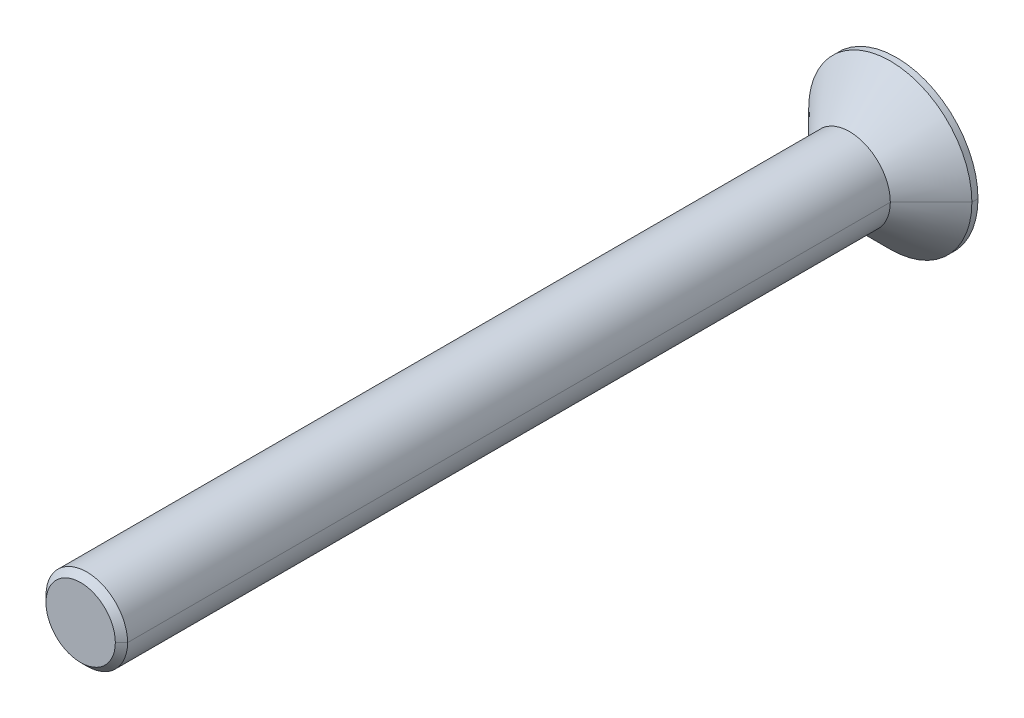
ISO-10303-21;
HEADER;
FILE_DESCRIPTION(('STEP AP214'),'2;1');
FILE_NAME('part.step','',(''),(''),'','','');
FILE_SCHEMA(('AUTOMOTIVE_DESIGN { 1 0 10303 214 1 1 1 1 }'));
ENDSEC;
DATA;
#1=APPLICATION_CONTEXT('core data for automotive mechanical design processes');
#2=APPLICATION_PROTOCOL_DEFINITION('international standard','automotive_design',2000,#1);
#3=PRODUCT_CONTEXT('',#1,'mechanical');
#4=PRODUCT('Part','Part','',(#3));
#5=PRODUCT_RELATED_PRODUCT_CATEGORY('part','',(#4));
#6=PRODUCT_DEFINITION_FORMATION('','',#4);
#7=PRODUCT_DEFINITION_CONTEXT('part definition',#1,'design');
#8=PRODUCT_DEFINITION('design','',#6,#7);
#9=PRODUCT_DEFINITION_SHAPE('','',#8);
#10=(LENGTH_UNIT() NAMED_UNIT(*) SI_UNIT(.MILLI.,.METRE.));
#11=(NAMED_UNIT(*) PLANE_ANGLE_UNIT() SI_UNIT($,.RADIAN.));
#12=(NAMED_UNIT(*) SI_UNIT($,.STERADIAN.) SOLID_ANGLE_UNIT());
#13=UNCERTAINTY_MEASURE_WITH_UNIT(LENGTH_MEASURE(1.E-05),#10,'distance_accuracy_value','');
#14=(GEOMETRIC_REPRESENTATION_CONTEXT(3) GLOBAL_UNCERTAINTY_ASSIGNED_CONTEXT((#13)) GLOBAL_UNIT_ASSIGNED_CONTEXT((#10,
#11,#12)) REPRESENTATION_CONTEXT('',''));
#15=CARTESIAN_POINT('',(0.,0.,0.));
#16=DIRECTION('',(0.,0.,1.));
#17=DIRECTION('',(1.,0.,0.));
#18=AXIS2_PLACEMENT_3D('',#15,#16,#17);
#19=CARTESIAN_POINT('',(0.,0.,-0.3));
#20=DIRECTION('',(0.,0.,-1.));
#21=DIRECTION('',(0.,-1.,0.));
#22=AXIS2_PLACEMENT_3D('',#19,#20,#21);
#23=PLANE('',#22);
#24=DIRECTION('',(-0.5,-0.866025403784439,0.));
#25=VECTOR('',#24,1.);
#26=CARTESIAN_POINT('',(1.44337567297406,0.,-0.3));
#27=LINE('',#26,#25);
#28=CARTESIAN_POINT('',(1.44337567297406,0.,-0.3));
#29=VERTEX_POINT('',#28);
#30=CARTESIAN_POINT('',(0.721687836487032,-1.25,-0.3));
#31=VERTEX_POINT('',#30);
#32=EDGE_CURVE('E124',#29,#31,#27,.T.);
#33=ORIENTED_EDGE('',*,*,#32,.T.);
#34=DIRECTION('',(-1.,0.,0.));
#35=VECTOR('',#34,1.);
#36=CARTESIAN_POINT('',(0.721687836487032,-1.25,-0.3));
#37=LINE('',#36,#35);
#38=CARTESIAN_POINT('',(-0.721687836487033,-1.25,-0.3));
#39=VERTEX_POINT('',#38);
#40=EDGE_CURVE('E11',#31,#39,#37,.T.);
#41=ORIENTED_EDGE('',*,*,#40,.T.);
#42=DIRECTION('',(-0.5,0.866025403784439,0.));
#43=VECTOR('',#42,1.);
#44=CARTESIAN_POINT('',(-0.721687836487033,-1.25,-0.3));
#45=LINE('',#44,#43);
#46=CARTESIAN_POINT('',(-1.44337567297406,0.,-0.3));
#47=VERTEX_POINT('',#46);
#48=EDGE_CURVE('E48',#39,#47,#45,.T.);
#49=ORIENTED_EDGE('',*,*,#48,.T.);
#50=DIRECTION('',(0.5,0.866025403784438,0.));
#51=VECTOR('',#50,1.);
#52=CARTESIAN_POINT('',(-1.44337567297406,0.,-0.3));
#53=LINE('',#52,#51);
#54=CARTESIAN_POINT('',(-0.721687836487032,1.25,-0.3));
#55=VERTEX_POINT('',#54);
#56=EDGE_CURVE('E98',#47,#55,#53,.T.);
#57=ORIENTED_EDGE('',*,*,#56,.T.);
#58=DIRECTION('',(1.,0.,0.));
#59=VECTOR('',#58,1.);
#60=CARTESIAN_POINT('',(-0.721687836487032,1.25,-0.3));
#61=LINE('',#60,#59);
#62=CARTESIAN_POINT('',(0.721687836487033,1.25,-0.3));
#63=VERTEX_POINT('',#62);
#64=EDGE_CURVE('E92',#55,#63,#61,.T.);
#65=ORIENTED_EDGE('',*,*,#64,.T.);
#66=DIRECTION('',(0.5,-0.866025403784439,0.));
#67=VECTOR('',#66,1.);
#68=CARTESIAN_POINT('',(0.721687836487033,1.25,-0.3));
#69=LINE('',#68,#67);
#70=EDGE_CURVE('E95',#63,#29,#69,.T.);
#71=ORIENTED_EDGE('',*,*,#70,.T.);
#72=EDGE_LOOP('',(#33,#41,#49,#57,#65,#71));
#73=FACE_BOUND('',#72,.T.);
#74=ADVANCED_FACE('F17',(#73),#23,.T.);
#75=CARTESIAN_POINT('',(0.721687836487032,-1.25,-0.3));
#76=DIRECTION('',(0.,-1.,0.));
#77=DIRECTION('',(-1.,0.,0.));
#78=AXIS2_PLACEMENT_3D('',#75,#76,#77);
#79=PLANE('',#78);
#80=DIRECTION('',(-1.,0.,0.));
#81=VECTOR('',#80,1.);
#82=CARTESIAN_POINT('',(0.721687836487032,-1.25,-2.3));
#83=LINE('',#82,#81);
#84=CARTESIAN_POINT('',(0.721687836487032,-1.25,-2.3));
#85=VERTEX_POINT('',#84);
#86=CARTESIAN_POINT('',(-0.721687836487033,-1.25,-2.3));
#87=VERTEX_POINT('',#86);
#88=EDGE_CURVE('E154',#85,#87,#83,.T.);
#89=ORIENTED_EDGE('',*,*,#88,.T.);
#90=DIRECTION('',(0.,0.,-1.));
#91=VECTOR('',#90,1.);
#92=CARTESIAN_POINT('',(-0.721687836487033,-1.25,-0.3));
#93=LINE('',#92,#91);
#94=EDGE_CURVE('E20',#39,#87,#93,.T.);
#95=ORIENTED_EDGE('',*,*,#94,.F.);
#96=ORIENTED_EDGE('',*,*,#40,.F.);
#97=DIRECTION('',(0.,0.,-1.));
#98=VECTOR('',#97,1.);
#99=CARTESIAN_POINT('',(0.721687836487032,-1.25,-0.3));
#100=LINE('',#99,#98);
#101=EDGE_CURVE('E158',#31,#85,#100,.T.);
#102=ORIENTED_EDGE('',*,*,#101,.T.);
#103=EDGE_LOOP('',(#89,#95,#96,#102));
#104=FACE_BOUND('',#103,.T.);
#105=ADVANCED_FACE('F160',(#104),#79,.F.);
#106=CARTESIAN_POINT('',(-0.721687836487033,-1.25,-0.3));
#107=DIRECTION('',(-0.866025403784439,-0.5,0.));
#108=DIRECTION('',(-0.5,0.866025403784439,0.));
#109=AXIS2_PLACEMENT_3D('',#106,#107,#108);
#110=PLANE('',#109);
#111=DIRECTION('',(-0.5,0.866025403784439,0.));
#112=VECTOR('',#111,1.);
#113=CARTESIAN_POINT('',(-0.721687836487033,-1.25,-2.3));
#114=LINE('',#113,#112);
#115=CARTESIAN_POINT('',(-1.44337567297406,0.,-2.3));
#116=VERTEX_POINT('',#115);
#117=EDGE_CURVE('E145',#87,#116,#114,.T.);
#118=ORIENTED_EDGE('',*,*,#117,.T.);
#119=DIRECTION('',(0.,0.,-1.));
#120=VECTOR('',#119,1.);
#121=CARTESIAN_POINT('',(-1.44337567297406,0.,-0.3));
#122=LINE('',#121,#120);
#123=EDGE_CURVE('E132',#47,#116,#122,.T.);
#124=ORIENTED_EDGE('',*,*,#123,.F.);
#125=ORIENTED_EDGE('',*,*,#48,.F.);
#126=ORIENTED_EDGE('',*,*,#94,.T.);
#127=EDGE_LOOP('',(#118,#124,#125,#126));
#128=FACE_BOUND('',#127,.T.);
#129=ADVANCED_FACE('F144',(#128),#110,.F.);
#130=CARTESIAN_POINT('',(-1.44337567297406,0.,-0.3));
#131=DIRECTION('',(-0.866025403784438,0.5,0.));
#132=DIRECTION('',(0.,0.,1.));
#133=AXIS2_PLACEMENT_3D('',#130,#131,#132);
#134=PLANE('',#133);
#135=DIRECTION('',(0.5,0.866025403784438,0.));
#136=VECTOR('',#135,1.);
#137=CARTESIAN_POINT('',(-1.44337567297406,0.,-2.3));
#138=LINE('',#137,#136);
#139=CARTESIAN_POINT('',(-0.721687836487032,1.25,-2.3));
#140=VERTEX_POINT('',#139);
#141=EDGE_CURVE('E156',#116,#140,#138,.T.);
#142=ORIENTED_EDGE('',*,*,#141,.T.);
#143=DIRECTION('',(0.,0.,-1.));
#144=VECTOR('',#143,1.);
#145=CARTESIAN_POINT('',(-0.721687836487032,1.25,-0.3));
#146=LINE('',#145,#144);
#147=EDGE_CURVE('E102',#55,#140,#146,.T.);
#148=ORIENTED_EDGE('',*,*,#147,.F.);
#149=ORIENTED_EDGE('',*,*,#56,.F.);
#150=ORIENTED_EDGE('',*,*,#123,.T.);
#151=EDGE_LOOP('',(#142,#148,#149,#150));
#152=FACE_BOUND('',#151,.T.);
#153=ADVANCED_FACE('F343',(#152),#134,.F.);
#154=CARTESIAN_POINT('',(-0.721687836487032,1.25,-0.3));
#155=DIRECTION('',(0.,1.,0.));
#156=DIRECTION('',(1.,0.,0.));
#157=AXIS2_PLACEMENT_3D('',#154,#155,#156);
#158=PLANE('',#157);
#159=DIRECTION('',(1.,0.,0.));
#160=VECTOR('',#159,1.);
#161=CARTESIAN_POINT('',(-0.721687836487032,1.25,-2.3));
#162=LINE('',#161,#160);
#163=CARTESIAN_POINT('',(0.721687836487033,1.25,-2.3));
#164=VERTEX_POINT('',#163);
#165=EDGE_CURVE('E108',#140,#164,#162,.T.);
#166=ORIENTED_EDGE('',*,*,#165,.T.);
#167=DIRECTION('',(0.,0.,-1.));
#168=VECTOR('',#167,1.);
#169=CARTESIAN_POINT('',(0.721687836487033,1.25,-0.3));
#170=LINE('',#169,#168);
#171=EDGE_CURVE('E103',#63,#164,#170,.T.);
#172=ORIENTED_EDGE('',*,*,#171,.F.);
#173=ORIENTED_EDGE('',*,*,#64,.F.);
#174=ORIENTED_EDGE('',*,*,#147,.T.);
#175=EDGE_LOOP('',(#166,#172,#173,#174));
#176=FACE_BOUND('',#175,.T.);
#177=ADVANCED_FACE('F106',(#176),#158,.F.);
#178=CARTESIAN_POINT('',(0.721687836487033,1.25,-0.3));
#179=DIRECTION('',(0.866025403784439,0.5,0.));
#180=DIRECTION('',(0.,0.,-1.));
#181=AXIS2_PLACEMENT_3D('',#178,#179,#180);
#182=PLANE('',#181);
#183=DIRECTION('',(0.5,-0.866025403784439,0.));
#184=VECTOR('',#183,1.);
#185=CARTESIAN_POINT('',(0.721687836487033,1.25,-2.3));
#186=LINE('',#185,#184);
#187=CARTESIAN_POINT('',(1.44337567297406,0.,-2.3));
#188=VERTEX_POINT('',#187);
#189=EDGE_CURVE('E171',#164,#188,#186,.T.);
#190=ORIENTED_EDGE('',*,*,#189,.T.);
#191=DIRECTION('',(0.,0.,-1.));
#192=VECTOR('',#191,1.);
#193=CARTESIAN_POINT('',(1.44337567297406,0.,-0.3));
#194=LINE('',#193,#192);
#195=EDGE_CURVE('E116',#29,#188,#194,.T.);
#196=ORIENTED_EDGE('',*,*,#195,.F.);
#197=ORIENTED_EDGE('',*,*,#70,.F.);
#198=ORIENTED_EDGE('',*,*,#171,.T.);
#199=EDGE_LOOP('',(#190,#196,#197,#198));
#200=FACE_BOUND('',#199,.T.);
#201=ADVANCED_FACE('F114',(#200),#182,.F.);
#202=CARTESIAN_POINT('',(1.44337567297406,0.,-0.3));
#203=DIRECTION('',(0.866025403784439,-0.5,0.));
#204=DIRECTION('',(0.,0.,-1.));
#205=AXIS2_PLACEMENT_3D('',#202,#203,#204);
#206=PLANE('',#205);
#207=DIRECTION('',(-0.5,-0.866025403784439,0.));
#208=VECTOR('',#207,1.);
#209=CARTESIAN_POINT('',(1.44337567297406,0.,-2.3));
#210=LINE('',#209,#208);
#211=EDGE_CURVE('E164',#188,#85,#210,.T.);
#212=ORIENTED_EDGE('',*,*,#211,.T.);
#213=ORIENTED_EDGE('',*,*,#101,.F.);
#214=ORIENTED_EDGE('',*,*,#32,.F.);
#215=ORIENTED_EDGE('',*,*,#195,.T.);
#216=EDGE_LOOP('',(#212,#213,#214,#215));
#217=FACE_BOUND('',#216,.T.);
#218=ADVANCED_FACE('F349',(#217),#206,.F.);
#219=CARTESIAN_POINT('',(0.,0.,37.7));
#220=DIRECTION('',(0.,0.,-1.));
#221=DIRECTION('',(-1.,0.,0.));
#222=AXIS2_PLACEMENT_3D('',#219,#220,#221);
#223=CONICAL_SURFACE('',#222,1.7,0.785398163397469);
#224=DIRECTION('',(0.707106781186562,0.,-0.707106781186533));
#225=VECTOR('',#224,1.);
#226=CARTESIAN_POINT('',(1.7,0.,37.7));
#227=LINE('',#226,#225);
#228=CARTESIAN_POINT('',(1.7,0.,37.7));
#229=VERTEX_POINT('',#228);
#230=CARTESIAN_POINT('',(2.,0.,37.4));
#231=VERTEX_POINT('',#230);
#232=EDGE_CURVE('E200',#229,#231,#227,.T.);
#233=ORIENTED_EDGE('',*,*,#232,.F.);
#234=CARTESIAN_POINT('',(0.,0.,37.7));
#235=DIRECTION('',(0.,0.,1.));
#236=DIRECTION('',(1.,0.,0.));
#237=AXIS2_PLACEMENT_3D('',#234,#235,#236);
#238=CIRCLE('',#237,1.7);
#239=CARTESIAN_POINT('',(-1.7,0.,37.7));
#240=VERTEX_POINT('',#239);
#241=EDGE_CURVE('E174',#240,#229,#238,.T.);
#242=ORIENTED_EDGE('',*,*,#241,.F.);
#243=DIRECTION('',(-0.707106781186562,0.,-0.707106781186533));
#244=VECTOR('',#243,1.);
#245=CARTESIAN_POINT('',(-1.7,0.,37.7));
#246=LINE('',#245,#244);
#247=CARTESIAN_POINT('',(-2.,0.,37.4));
#248=VERTEX_POINT('',#247);
#249=EDGE_CURVE('E212',#240,#248,#246,.T.);
#250=ORIENTED_EDGE('',*,*,#249,.T.);
#251=CARTESIAN_POINT('',(0.,0.,37.4));
#252=DIRECTION('',(0.,0.,-1.));
#253=DIRECTION('',(1.,0.,0.));
#254=AXIS2_PLACEMENT_3D('',#251,#252,#253);
#255=CIRCLE('',#254,2.);
#256=EDGE_CURVE('E238',#231,#248,#255,.T.);
#257=ORIENTED_EDGE('',*,*,#256,.F.);
#258=EDGE_LOOP('',(#233,#242,#250,#257));
#259=FACE_BOUND('',#258,.T.);
#260=ADVANCED_FACE('F258',(#259),#223,.T.);
#261=CARTESIAN_POINT('',(0.,0.,-2.3));
#262=DIRECTION('',(0.,0.,1.));
#263=DIRECTION('',(1.,0.,0.));
#264=AXIS2_PLACEMENT_3D('',#261,#262,#263);
#265=PLANE('',#264);
#266=ORIENTED_EDGE('',*,*,#88,.F.);
#267=ORIENTED_EDGE('',*,*,#211,.F.);
#268=ORIENTED_EDGE('',*,*,#189,.F.);
#269=ORIENTED_EDGE('',*,*,#165,.F.);
#270=ORIENTED_EDGE('',*,*,#141,.F.);
#271=ORIENTED_EDGE('',*,*,#117,.F.);
#272=EDGE_LOOP('',(#266,#267,#268,#269,#270,#271));
#273=FACE_BOUND('',#272,.T.);
#274=CARTESIAN_POINT('',(0.,0.,-2.3));
#275=DIRECTION('',(0.,0.,-1.));
#276=DIRECTION('',(-1.,0.,0.));
#277=AXIS2_PLACEMENT_3D('',#274,#275,#276);
#278=CIRCLE('',#277,4.);
#279=CARTESIAN_POINT('',(-4.,0.,-2.3));
#280=VERTEX_POINT('',#279);
#281=CARTESIAN_POINT('',(4.,0.,-2.3));
#282=VERTEX_POINT('',#281);
#283=EDGE_CURVE('E194',#280,#282,#278,.T.);
#284=ORIENTED_EDGE('',*,*,#283,.T.);
#285=CARTESIAN_POINT('',(0.,0.,-2.3));
#286=DIRECTION('',(0.,0.,-1.));
#287=DIRECTION('',(-1.,0.,0.));
#288=AXIS2_PLACEMENT_3D('',#285,#286,#287);
#289=CIRCLE('',#288,4.);
#290=EDGE_CURVE('E165',#282,#280,#289,.T.);
#291=ORIENTED_EDGE('',*,*,#290,.T.);
#292=EDGE_LOOP('',(#284,#291));
#293=FACE_BOUND('',#292,.T.);
#294=ADVANCED_FACE('F151',(#273,#293),#265,.F.);
#295=CARTESIAN_POINT('',(0.,0.,37.7));
#296=DIRECTION('',(0.,0.,-1.));
#297=DIRECTION('',(-1.,0.,0.));
#298=AXIS2_PLACEMENT_3D('',#295,#296,#297);
#299=CYLINDRICAL_SURFACE('',#298,4.);
#300=DIRECTION('',(0.,0.,-1.));
#301=VECTOR('',#300,1.);
#302=CARTESIAN_POINT('',(4.,0.,37.7));
#303=LINE('',#302,#301);
#304=CARTESIAN_POINT('',(4.,0.,-2.));
#305=VERTEX_POINT('',#304);
#306=EDGE_CURVE('E199',#305,#282,#303,.T.);
#307=ORIENTED_EDGE('',*,*,#306,.F.);
#308=CARTESIAN_POINT('',(0.,0.,-2.));
#309=DIRECTION('',(0.,0.,1.));
#310=DIRECTION('',(-1.,0.,0.));
#311=AXIS2_PLACEMENT_3D('',#308,#309,#310);
#312=CIRCLE('',#311,4.);
#313=CARTESIAN_POINT('',(-4.,0.,-2.));
#314=VERTEX_POINT('',#313);
#315=EDGE_CURVE('E223',#314,#305,#312,.T.);
#316=ORIENTED_EDGE('',*,*,#315,.F.);
#317=DIRECTION('',(0.,0.,-1.));
#318=VECTOR('',#317,1.);
#319=CARTESIAN_POINT('',(-4.,0.,37.7));
#320=LINE('',#319,#318);
#321=EDGE_CURVE('E198',#314,#280,#320,.T.);
#322=ORIENTED_EDGE('',*,*,#321,.T.);
#323=ORIENTED_EDGE('',*,*,#290,.F.);
#324=EDGE_LOOP('',(#307,#316,#322,#323));
#325=FACE_BOUND('',#324,.T.);
#326=ADVANCED_FACE('F321',(#325),#299,.T.);
#327=CARTESIAN_POINT('',(0.,0.,37.7));
#328=DIRECTION('',(0.,0.,1.));
#329=DIRECTION('',(1.,0.,0.));
#330=AXIS2_PLACEMENT_3D('',#327,#328,#329);
#331=PLANE('',#330);
#332=ORIENTED_EDGE('',*,*,#241,.T.);
#333=CARTESIAN_POINT('',(0.,0.,37.7));
#334=DIRECTION('',(0.,0.,1.));
#335=DIRECTION('',(1.,0.,0.));
#336=AXIS2_PLACEMENT_3D('',#333,#334,#335);
#337=CIRCLE('',#336,1.7);
#338=EDGE_CURVE('E204',#229,#240,#337,.T.);
#339=ORIENTED_EDGE('',*,*,#338,.T.);
#340=EDGE_LOOP('',(#332,#339));
#341=FACE_BOUND('',#340,.T.);
#342=ADVANCED_FACE('F250',(#341),#331,.T.);
#343=CARTESIAN_POINT('',(0.,0.,37.7));
#344=DIRECTION('',(0.,0.,-1.));
#345=DIRECTION('',(-1.,0.,0.));
#346=AXIS2_PLACEMENT_3D('',#343,#344,#345);
#347=CYLINDRICAL_SURFACE('',#346,2.);
#348=DIRECTION('',(0.,0.,-1.));
#349=VECTOR('',#348,1.);
#350=CARTESIAN_POINT('',(2.,0.,37.7));
#351=LINE('',#350,#349);
#352=CARTESIAN_POINT('',(2.,0.,0.));
#353=VERTEX_POINT('',#352);
#354=EDGE_CURVE('E192',#231,#353,#351,.T.);
#355=ORIENTED_EDGE('',*,*,#354,.F.);
#356=ORIENTED_EDGE('',*,*,#256,.T.);
#357=DIRECTION('',(0.,0.,-1.));
#358=VECTOR('',#357,1.);
#359=CARTESIAN_POINT('',(-2.,0.,37.7));
#360=LINE('',#359,#358);
#361=CARTESIAN_POINT('',(-2.,0.,0.));
#362=VERTEX_POINT('',#361);
#363=EDGE_CURVE('E211',#248,#362,#360,.T.);
#364=ORIENTED_EDGE('',*,*,#363,.T.);
#365=CARTESIAN_POINT('',(0.,0.,0.));
#366=DIRECTION('',(0.,0.,1.));
#367=DIRECTION('',(1.,0.,0.));
#368=AXIS2_PLACEMENT_3D('',#365,#366,#367);
#369=CIRCLE('',#368,2.);
#370=EDGE_CURVE('E206',#362,#353,#369,.T.);
#371=ORIENTED_EDGE('',*,*,#370,.T.);
#372=EDGE_LOOP('',(#355,#356,#364,#371));
#373=FACE_BOUND('',#372,.T.);
#374=ADVANCED_FACE('F292',(#373),#347,.T.);
#375=CARTESIAN_POINT('',(0.,0.,0.));
#376=DIRECTION('',(0.,0.,-1.));
#377=DIRECTION('',(1.,0.,0.));
#378=AXIS2_PLACEMENT_3D('',#375,#376,#377);
#379=CONICAL_SURFACE('',#378,2.,0.78539816339745);
#380=DIRECTION('',(-0.707106781186549,0.,-0.707106781186546));
#381=VECTOR('',#380,1.);
#382=CARTESIAN_POINT('',(-2.,0.,0.));
#383=LINE('',#382,#381);
#384=EDGE_CURVE('E210',#362,#314,#383,.T.);
#385=ORIENTED_EDGE('',*,*,#384,.F.);
#386=CARTESIAN_POINT('',(0.,0.,0.));
#387=DIRECTION('',(0.,0.,1.));
#388=DIRECTION('',(1.,0.,0.));
#389=AXIS2_PLACEMENT_3D('',#386,#387,#388);
#390=CIRCLE('',#389,2.);
#391=EDGE_CURVE('E224',#353,#362,#390,.T.);
#392=ORIENTED_EDGE('',*,*,#391,.F.);
#393=DIRECTION('',(0.707106781186549,0.,-0.707106781186546));
#394=VECTOR('',#393,1.);
#395=CARTESIAN_POINT('',(2.,0.,0.));
#396=LINE('',#395,#394);
#397=EDGE_CURVE('E234',#353,#305,#396,.T.);
#398=ORIENTED_EDGE('',*,*,#397,.T.);
#399=CARTESIAN_POINT('',(0.,0.,-2.));
#400=DIRECTION('',(0.,0.,1.));
#401=DIRECTION('',(-1.,0.,0.));
#402=AXIS2_PLACEMENT_3D('',#399,#400,#401);
#403=CIRCLE('',#402,4.);
#404=EDGE_CURVE('E216',#305,#314,#403,.T.);
#405=ORIENTED_EDGE('',*,*,#404,.T.);
#406=EDGE_LOOP('',(#385,#392,#398,#405));
#407=FACE_BOUND('',#406,.T.);
#408=ADVANCED_FACE('F325',(#407),#379,.T.);
#409=CARTESIAN_POINT('',(0.,0.,0.));
#410=DIRECTION('',(0.,0.,-1.));
#411=DIRECTION('',(1.,0.,0.));
#412=AXIS2_PLACEMENT_3D('',#409,#410,#411);
#413=CONICAL_SURFACE('',#412,2.,0.78539816339745);
#414=ORIENTED_EDGE('',*,*,#370,.F.);
#415=ORIENTED_EDGE('',*,*,#384,.T.);
#416=ORIENTED_EDGE('',*,*,#315,.T.);
#417=ORIENTED_EDGE('',*,*,#397,.F.);
#418=EDGE_LOOP('',(#414,#415,#416,#417));
#419=FACE_BOUND('',#418,.T.);
#420=ADVANCED_FACE('F323',(#419),#413,.T.);
#421=CARTESIAN_POINT('',(0.,0.,37.7));
#422=DIRECTION('',(0.,0.,-1.));
#423=DIRECTION('',(-1.,0.,0.));
#424=AXIS2_PLACEMENT_3D('',#421,#422,#423);
#425=CYLINDRICAL_SURFACE('',#424,2.);
#426=CARTESIAN_POINT('',(0.,0.,37.4));
#427=DIRECTION('',(0.,0.,-1.));
#428=DIRECTION('',(1.,0.,0.));
#429=AXIS2_PLACEMENT_3D('',#426,#427,#428);
#430=CIRCLE('',#429,2.);
#431=EDGE_CURVE('E203',#248,#231,#430,.T.);
#432=ORIENTED_EDGE('',*,*,#431,.T.);
#433=ORIENTED_EDGE('',*,*,#354,.T.);
#434=ORIENTED_EDGE('',*,*,#391,.T.);
#435=ORIENTED_EDGE('',*,*,#363,.F.);
#436=EDGE_LOOP('',(#432,#433,#434,#435));
#437=FACE_BOUND('',#436,.T.);
#438=ADVANCED_FACE('F288',(#437),#425,.T.);
#439=CARTESIAN_POINT('',(0.,0.,37.7));
#440=DIRECTION('',(0.,0.,-1.));
#441=DIRECTION('',(-1.,0.,0.));
#442=AXIS2_PLACEMENT_3D('',#439,#440,#441);
#443=CYLINDRICAL_SURFACE('',#442,4.);
#444=ORIENTED_EDGE('',*,*,#404,.F.);
#445=ORIENTED_EDGE('',*,*,#306,.T.);
#446=ORIENTED_EDGE('',*,*,#283,.F.);
#447=ORIENTED_EDGE('',*,*,#321,.F.);
#448=EDGE_LOOP('',(#444,#445,#446,#447));
#449=FACE_BOUND('',#448,.T.);
#450=ADVANCED_FACE('F320',(#449),#443,.T.);
#451=CARTESIAN_POINT('',(0.,0.,37.7));
#452=DIRECTION('',(0.,0.,-1.));
#453=DIRECTION('',(-1.,0.,0.));
#454=AXIS2_PLACEMENT_3D('',#451,#452,#453);
#455=CONICAL_SURFACE('',#454,1.7,0.785398163397469);
#456=ORIENTED_EDGE('',*,*,#338,.F.);
#457=ORIENTED_EDGE('',*,*,#232,.T.);
#458=ORIENTED_EDGE('',*,*,#431,.F.);
#459=ORIENTED_EDGE('',*,*,#249,.F.);
#460=EDGE_LOOP('',(#456,#457,#458,#459));
#461=FACE_BOUND('',#460,.T.);
#462=ADVANCED_FACE('F263',(#461),#455,.T.);
#463=CLOSED_SHELL('',(#74,#105,#129,#153,#177,#201,#218,#260,#294,#326,#342,#374,#408,#420,#438,
#450,#462));
#464=MANIFOLD_SOLID_BREP('B1',#463);
#465=ADVANCED_BREP_SHAPE_REPRESENTATION('',(#18,#464),#14);
#466=SHAPE_DEFINITION_REPRESENTATION(#9,#465);
ENDSEC;
END-ISO-10303-21;
